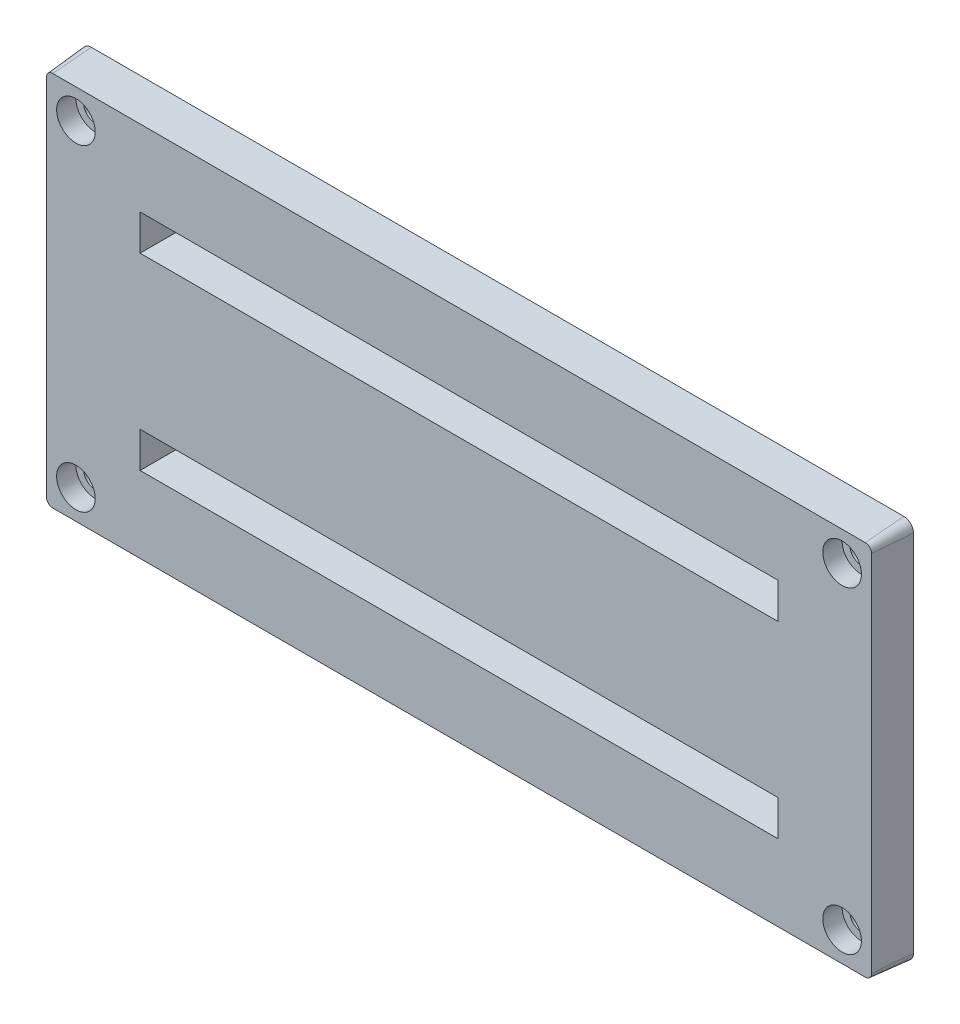
ISO-10303-21;
HEADER;
FILE_DESCRIPTION(('STEP AP214'),'2;1');
FILE_NAME('part.step','',(''),(''),'','','');
FILE_SCHEMA(('AUTOMOTIVE_DESIGN { 1 0 10303 214 1 1 1 1 }'));
ENDSEC;
DATA;
#1=APPLICATION_CONTEXT('core data for automotive mechanical design processes');
#2=APPLICATION_PROTOCOL_DEFINITION('international standard','automotive_design',2000,#1);
#3=PRODUCT_CONTEXT('',#1,'mechanical');
#4=PRODUCT('Part','Part','',(#3));
#5=PRODUCT_RELATED_PRODUCT_CATEGORY('part','',(#4));
#6=PRODUCT_DEFINITION_FORMATION('','',#4);
#7=PRODUCT_DEFINITION_CONTEXT('part definition',#1,'design');
#8=PRODUCT_DEFINITION('design','',#6,#7);
#9=PRODUCT_DEFINITION_SHAPE('','',#8);
#10=(LENGTH_UNIT() NAMED_UNIT(*) SI_UNIT(.MILLI.,.METRE.));
#11=(NAMED_UNIT(*) PLANE_ANGLE_UNIT() SI_UNIT($,.RADIAN.));
#12=(NAMED_UNIT(*) SI_UNIT($,.STERADIAN.) SOLID_ANGLE_UNIT());
#13=UNCERTAINTY_MEASURE_WITH_UNIT(LENGTH_MEASURE(1.E-05),#10,'distance_accuracy_value','');
#14=(GEOMETRIC_REPRESENTATION_CONTEXT(3) GLOBAL_UNCERTAINTY_ASSIGNED_CONTEXT((#13)) GLOBAL_UNIT_ASSIGNED_CONTEXT((#10,
#11,#12)) REPRESENTATION_CONTEXT('',''));
#15=CARTESIAN_POINT('',(0.,0.,0.));
#16=DIRECTION('',(0.,0.,1.));
#17=DIRECTION('',(1.,0.,0.));
#18=AXIS2_PLACEMENT_3D('',#15,#16,#17);
#19=CARTESIAN_POINT('',(39.7,26.2,11.6));
#20=DIRECTION('',(0.,0.,1.));
#21=DIRECTION('',(1.,0.,0.));
#22=AXIS2_PLACEMENT_3D('',#19,#20,#21);
#23=CYLINDRICAL_SURFACE('',#22,1.2);
#24=CARTESIAN_POINT('',(39.7,26.2,11.6));
#25=DIRECTION('',(0.,0.,1.));
#26=DIRECTION('',(1.,0.,0.));
#27=AXIS2_PLACEMENT_3D('',#24,#25,#26);
#28=CIRCLE('',#27,1.2);
#29=CARTESIAN_POINT('',(40.9,26.2,11.6));
#30=VERTEX_POINT('',#29);
#31=EDGE_CURVE('E285',#30,#30,#28,.T.);
#32=ORIENTED_EDGE('',*,*,#31,.F.);
#33=EDGE_LOOP('',(#32));
#34=FACE_BOUND('',#33,.T.);
#35=CARTESIAN_POINT('',(39.7,26.2,13.6));
#36=DIRECTION('',(0.,0.,1.));
#37=DIRECTION('',(1.,0.,0.));
#38=AXIS2_PLACEMENT_3D('',#35,#36,#37);
#39=CIRCLE('',#38,1.2);
#40=CARTESIAN_POINT('',(40.9,26.2,13.6));
#41=VERTEX_POINT('',#40);
#42=EDGE_CURVE('E46',#41,#41,#39,.F.);
#43=ORIENTED_EDGE('',*,*,#42,.F.);
#44=EDGE_LOOP('',(#43));
#45=FACE_BOUND('',#44,.T.);
#46=ADVANCED_FACE('F42',(#34,#45),#23,.F.);
#47=CARTESIAN_POINT('',(39.7,-6.7,11.6));
#48=DIRECTION('',(0.,0.,1.));
#49=DIRECTION('',(1.,0.,0.));
#50=AXIS2_PLACEMENT_3D('',#47,#48,#49);
#51=CYLINDRICAL_SURFACE('',#50,1.2);
#52=CARTESIAN_POINT('',(39.7,-6.7,11.6));
#53=DIRECTION('',(0.,0.,1.));
#54=DIRECTION('',(1.,0.,0.));
#55=AXIS2_PLACEMENT_3D('',#52,#53,#54);
#56=CIRCLE('',#55,1.2);
#57=CARTESIAN_POINT('',(40.9,-6.7,11.6));
#58=VERTEX_POINT('',#57);
#59=EDGE_CURVE('E312',#58,#58,#56,.T.);
#60=ORIENTED_EDGE('',*,*,#59,.F.);
#61=EDGE_LOOP('',(#60));
#62=FACE_BOUND('',#61,.T.);
#63=CARTESIAN_POINT('',(39.7,-6.7,13.6));
#64=DIRECTION('',(0.,0.,1.));
#65=DIRECTION('',(1.,0.,0.));
#66=AXIS2_PLACEMENT_3D('',#63,#64,#65);
#67=CIRCLE('',#66,1.2);
#68=CARTESIAN_POINT('',(40.9,-6.7,13.6));
#69=VERTEX_POINT('',#68);
#70=EDGE_CURVE('E290',#69,#69,#67,.F.);
#71=ORIENTED_EDGE('',*,*,#70,.F.);
#72=EDGE_LOOP('',(#71));
#73=FACE_BOUND('',#72,.T.);
#74=ADVANCED_FACE('F384',(#62,#73),#51,.F.);
#75=CARTESIAN_POINT('',(-39.7,-6.69999999999999,11.6));
#76=DIRECTION('',(0.,0.,1.));
#77=DIRECTION('',(1.,0.,0.));
#78=AXIS2_PLACEMENT_3D('',#75,#76,#77);
#79=CYLINDRICAL_SURFACE('',#78,1.2);
#80=CARTESIAN_POINT('',(-39.7,-6.69999999999999,11.6));
#81=DIRECTION('',(0.,0.,1.));
#82=DIRECTION('',(1.,0.,0.));
#83=AXIS2_PLACEMENT_3D('',#80,#81,#82);
#84=CIRCLE('',#83,1.2);
#85=CARTESIAN_POINT('',(-38.5,-6.69999999999999,11.6));
#86=VERTEX_POINT('',#85);
#87=EDGE_CURVE('E307',#86,#86,#84,.T.);
#88=ORIENTED_EDGE('',*,*,#87,.F.);
#89=EDGE_LOOP('',(#88));
#90=FACE_BOUND('',#89,.T.);
#91=CARTESIAN_POINT('',(-39.7,-6.69999999999999,13.6));
#92=DIRECTION('',(0.,0.,1.));
#93=DIRECTION('',(1.,0.,0.));
#94=AXIS2_PLACEMENT_3D('',#91,#92,#93);
#95=CIRCLE('',#94,1.2);
#96=CARTESIAN_POINT('',(-38.5,-6.69999999999999,13.6));
#97=VERTEX_POINT('',#96);
#98=EDGE_CURVE('E287',#97,#97,#95,.F.);
#99=ORIENTED_EDGE('',*,*,#98,.F.);
#100=EDGE_LOOP('',(#99));
#101=FACE_BOUND('',#100,.T.);
#102=ADVANCED_FACE('F390',(#90,#101),#79,.F.);
#103=CARTESIAN_POINT('',(-39.7,26.2,11.6));
#104=DIRECTION('',(0.,0.,1.));
#105=DIRECTION('',(1.,0.,0.));
#106=AXIS2_PLACEMENT_3D('',#103,#104,#105);
#107=CYLINDRICAL_SURFACE('',#106,1.2);
#108=CARTESIAN_POINT('',(-39.7,26.2,11.6));
#109=DIRECTION('',(0.,0.,1.));
#110=DIRECTION('',(1.,0.,0.));
#111=AXIS2_PLACEMENT_3D('',#108,#109,#110);
#112=CIRCLE('',#111,1.2);
#113=CARTESIAN_POINT('',(-38.5,26.2,11.6));
#114=VERTEX_POINT('',#113);
#115=EDGE_CURVE('E311',#114,#114,#112,.T.);
#116=ORIENTED_EDGE('',*,*,#115,.F.);
#117=EDGE_LOOP('',(#116));
#118=FACE_BOUND('',#117,.T.);
#119=CARTESIAN_POINT('',(-39.7,26.2,13.6));
#120=DIRECTION('',(0.,0.,1.));
#121=DIRECTION('',(1.,0.,0.));
#122=AXIS2_PLACEMENT_3D('',#119,#120,#121);
#123=CIRCLE('',#122,1.2);
#124=CARTESIAN_POINT('',(-38.5,26.2,13.6));
#125=VERTEX_POINT('',#124);
#126=EDGE_CURVE('E282',#125,#125,#123,.F.);
#127=ORIENTED_EDGE('',*,*,#126,.F.);
#128=EDGE_LOOP('',(#127));
#129=FACE_BOUND('',#128,.T.);
#130=ADVANCED_FACE('F397',(#118,#129),#107,.F.);
#131=CARTESIAN_POINT('',(-42.1,-9.10000000000001,15.6));
#132=DIRECTION('',(0.,0.,1.));
#133=DIRECTION('',(1.,0.,0.));
#134=AXIS2_PLACEMENT_3D('',#131,#132,#133);
#135=PLANE('',#134);
#136=CARTESIAN_POINT('',(-39.7,-6.69999999999999,15.6));
#137=DIRECTION('',(0.,0.,1.));
#138=DIRECTION('',(1.,0.,0.));
#139=AXIS2_PLACEMENT_3D('',#136,#137,#138);
#140=CIRCLE('',#139,2.);
#141=CARTESIAN_POINT('',(-37.7,-6.69999999999999,15.6));
#142=VERTEX_POINT('',#141);
#143=EDGE_CURVE('E597',#142,#142,#140,.T.);
#144=ORIENTED_EDGE('',*,*,#143,.F.);
#145=EDGE_LOOP('',(#144));
#146=FACE_BOUND('',#145,.T.);
#147=CARTESIAN_POINT('',(39.7,-6.7,15.6));
#148=DIRECTION('',(0.,0.,1.));
#149=DIRECTION('',(1.,0.,0.));
#150=AXIS2_PLACEMENT_3D('',#147,#148,#149);
#151=CIRCLE('',#150,2.);
#152=CARTESIAN_POINT('',(41.7,-6.7,15.6));
#153=VERTEX_POINT('',#152);
#154=EDGE_CURVE('E589',#153,#153,#151,.T.);
#155=ORIENTED_EDGE('',*,*,#154,.F.);
#156=EDGE_LOOP('',(#155));
#157=FACE_BOUND('',#156,.T.);
#158=CARTESIAN_POINT('',(39.7,26.2,15.6));
#159=DIRECTION('',(0.,0.,1.));
#160=DIRECTION('',(1.,0.,0.));
#161=AXIS2_PLACEMENT_3D('',#158,#159,#160);
#162=CIRCLE('',#161,2.);
#163=CARTESIAN_POINT('',(41.7,26.2,15.6));
#164=VERTEX_POINT('',#163);
#165=EDGE_CURVE('E587',#164,#164,#162,.T.);
#166=ORIENTED_EDGE('',*,*,#165,.F.);
#167=EDGE_LOOP('',(#166));
#168=FACE_BOUND('',#167,.T.);
#169=CARTESIAN_POINT('',(-39.7,26.2,15.6));
#170=DIRECTION('',(0.,0.,1.));
#171=DIRECTION('',(1.,0.,0.));
#172=AXIS2_PLACEMENT_3D('',#169,#170,#171);
#173=CIRCLE('',#172,2.);
#174=CARTESIAN_POINT('',(-37.7,26.2,15.6));
#175=VERTEX_POINT('',#174);
#176=EDGE_CURVE('E296',#175,#175,#173,.T.);
#177=ORIENTED_EDGE('',*,*,#176,.F.);
#178=EDGE_LOOP('',(#177));
#179=FACE_BOUND('',#178,.T.);
#180=CARTESIAN_POINT('',(-42.1,-9.10000000000001,15.6));
#181=DIRECTION('',(0.,0.,1.));
#182=DIRECTION('',(1.,0.,0.));
#183=AXIS2_PLACEMENT_3D('',#180,#181,#182);
#184=CIRCLE('',#183,0.650045345896302);
#185=CARTESIAN_POINT('',(-42.7500453458963,-9.10000000000001,15.6));
#186=VERTEX_POINT('',#185);
#187=CARTESIAN_POINT('',(-42.1,-9.75004534589631,15.6));
#188=VERTEX_POINT('',#187);
#189=EDGE_CURVE('E182',#186,#188,#184,.T.);
#190=ORIENTED_EDGE('',*,*,#189,.T.);
#191=DIRECTION('',(-1.,0.,0.));
#192=VECTOR('',#191,1.);
#193=CARTESIAN_POINT('',(-42.1,-9.75004534589631,15.6));
#194=LINE('',#193,#192);
#195=CARTESIAN_POINT('',(42.1,-9.75004534589631,15.6));
#196=VERTEX_POINT('',#195);
#197=EDGE_CURVE('E267',#188,#196,#194,.F.);
#198=ORIENTED_EDGE('',*,*,#197,.T.);
#199=CARTESIAN_POINT('',(42.1,-9.1,15.6));
#200=DIRECTION('',(0.,0.,1.));
#201=DIRECTION('',(1.,0.,0.));
#202=AXIS2_PLACEMENT_3D('',#199,#200,#201);
#203=CIRCLE('',#202,0.650045345896304);
#204=CARTESIAN_POINT('',(42.7500453458963,-9.1,15.6));
#205=VERTEX_POINT('',#204);
#206=EDGE_CURVE('E270',#196,#205,#203,.T.);
#207=ORIENTED_EDGE('',*,*,#206,.T.);
#208=DIRECTION('',(0.,-1.,0.));
#209=VECTOR('',#208,1.);
#210=CARTESIAN_POINT('',(42.7500453458963,-9.1,15.6));
#211=LINE('',#210,#209);
#212=CARTESIAN_POINT('',(42.7500453458963,28.6,15.6));
#213=VERTEX_POINT('',#212);
#214=EDGE_CURVE('E272',#205,#213,#211,.F.);
#215=ORIENTED_EDGE('',*,*,#214,.T.);
#216=CARTESIAN_POINT('',(42.1,28.6,15.6));
#217=DIRECTION('',(0.,0.,1.));
#218=DIRECTION('',(1.,0.,0.));
#219=AXIS2_PLACEMENT_3D('',#216,#217,#218);
#220=CIRCLE('',#219,0.650045345896302);
#221=CARTESIAN_POINT('',(42.1,29.2500453458963,15.6));
#222=VERTEX_POINT('',#221);
#223=EDGE_CURVE('E275',#213,#222,#220,.T.);
#224=ORIENTED_EDGE('',*,*,#223,.T.);
#225=DIRECTION('',(1.,0.,0.));
#226=VECTOR('',#225,1.);
#227=CARTESIAN_POINT('',(42.1,29.2500453458963,15.6));
#228=LINE('',#227,#226);
#229=CARTESIAN_POINT('',(-42.1,29.2500453458963,15.6));
#230=VERTEX_POINT('',#229);
#231=EDGE_CURVE('E277',#222,#230,#228,.F.);
#232=ORIENTED_EDGE('',*,*,#231,.T.);
#233=CARTESIAN_POINT('',(-42.1,28.6,15.6));
#234=DIRECTION('',(0.,0.,1.));
#235=DIRECTION('',(1.,0.,0.));
#236=AXIS2_PLACEMENT_3D('',#233,#234,#235);
#237=CIRCLE('',#236,0.650045345896304);
#238=CARTESIAN_POINT('',(-42.7500453458963,28.6,15.6));
#239=VERTEX_POINT('',#238);
#240=EDGE_CURVE('E102',#230,#239,#237,.T.);
#241=ORIENTED_EDGE('',*,*,#240,.T.);
#242=DIRECTION('',(0.,1.,0.));
#243=VECTOR('',#242,1.);
#244=CARTESIAN_POINT('',(-42.7500453458963,28.6,15.6));
#245=LINE('',#244,#243);
#246=EDGE_CURVE('E107',#239,#186,#245,.F.);
#247=ORIENTED_EDGE('',*,*,#246,.T.);
#248=EDGE_LOOP('',(#190,#198,#207,#215,#224,#232,#241,#247));
#249=FACE_BOUND('',#248,.T.);
#250=DIRECTION('',(0.,-1.,0.));
#251=VECTOR('',#250,1.);
#252=CARTESIAN_POINT('',(-33.0499546541037,1.5,15.6));
#253=LINE('',#252,#251);
#254=CARTESIAN_POINT('',(-33.0499546541037,1.8499546541037,15.6));
#255=VERTEX_POINT('',#254);
#256=CARTESIAN_POINT('',(-33.0499546541037,-1.8499546541037,15.6));
#257=VERTEX_POINT('',#256);
#258=EDGE_CURVE('E222',#255,#257,#253,.T.);
#259=ORIENTED_EDGE('',*,*,#258,.F.);
#260=DIRECTION('',(-1.,0.,0.));
#261=VECTOR('',#260,1.);
#262=CARTESIAN_POINT('',(32.7,1.84995465410369,15.6));
#263=LINE('',#262,#261);
#264=CARTESIAN_POINT('',(33.0499546541037,1.84995465410369,15.6));
#265=VERTEX_POINT('',#264);
#266=EDGE_CURVE('E132',#265,#255,#263,.T.);
#267=ORIENTED_EDGE('',*,*,#266,.F.);
#268=DIRECTION('',(0.,1.,0.));
#269=VECTOR('',#268,1.);
#270=CARTESIAN_POINT('',(33.0499546541037,-1.49999999999999,15.6));
#271=LINE('',#270,#269);
#272=CARTESIAN_POINT('',(33.0499546541037,-1.84995465410369,15.6));
#273=VERTEX_POINT('',#272);
#274=EDGE_CURVE('E217',#273,#265,#271,.T.);
#275=ORIENTED_EDGE('',*,*,#274,.F.);
#276=DIRECTION('',(1.,0.,0.));
#277=VECTOR('',#276,1.);
#278=CARTESIAN_POINT('',(-32.7,-1.8499546541037,15.6));
#279=LINE('',#278,#277);
#280=EDGE_CURVE('E224',#257,#273,#279,.T.);
#281=ORIENTED_EDGE('',*,*,#280,.F.);
#282=EDGE_LOOP('',(#259,#267,#275,#281));
#283=FACE_BOUND('',#282,.T.);
#284=DIRECTION('',(0.,1.,0.));
#285=VECTOR('',#284,1.);
#286=CARTESIAN_POINT('',(33.0499546541037,18.,15.6));
#287=LINE('',#286,#285);
#288=CARTESIAN_POINT('',(33.0499546541037,17.6500453458963,15.6));
#289=VERTEX_POINT('',#288);
#290=CARTESIAN_POINT('',(33.0499546541037,21.3499546541037,15.6));
#291=VERTEX_POINT('',#290);
#292=EDGE_CURVE('E244',#289,#291,#287,.T.);
#293=ORIENTED_EDGE('',*,*,#292,.F.);
#294=DIRECTION('',(1.,0.,0.));
#295=VECTOR('',#294,1.);
#296=CARTESIAN_POINT('',(-32.7,17.6500453458963,15.6));
#297=LINE('',#296,#295);
#298=CARTESIAN_POINT('',(-33.0499546541037,17.6500453458963,15.6));
#299=VERTEX_POINT('',#298);
#300=EDGE_CURVE('E241',#299,#289,#297,.T.);
#301=ORIENTED_EDGE('',*,*,#300,.F.);
#302=DIRECTION('',(0.,-1.,0.));
#303=VECTOR('',#302,1.);
#304=CARTESIAN_POINT('',(-33.0499546541037,21.,15.6));
#305=LINE('',#304,#303);
#306=CARTESIAN_POINT('',(-33.0499546541037,21.3499546541037,15.6));
#307=VERTEX_POINT('',#306);
#308=EDGE_CURVE('E231',#307,#299,#305,.T.);
#309=ORIENTED_EDGE('',*,*,#308,.F.);
#310=DIRECTION('',(-1.,0.,0.));
#311=VECTOR('',#310,1.);
#312=CARTESIAN_POINT('',(32.7,21.3499546541037,15.6));
#313=LINE('',#312,#311);
#314=EDGE_CURVE('E247',#291,#307,#313,.T.);
#315=ORIENTED_EDGE('',*,*,#314,.F.);
#316=EDGE_LOOP('',(#293,#301,#309,#315));
#317=FACE_BOUND('',#316,.T.);
#318=ADVANCED_FACE('F346',(#146,#157,#168,#179,#249,#283,#317),#135,.T.);
#319=CARTESIAN_POINT('',(-42.1,-9.10000000000001,11.6));
#320=DIRECTION('',(0.,0.,1.));
#321=DIRECTION('',(1.,0.,0.));
#322=AXIS2_PLACEMENT_3D('',#319,#320,#321);
#323=PLANE('',#322);
#324=ORIENTED_EDGE('',*,*,#87,.T.);
#325=EDGE_LOOP('',(#324));
#326=FACE_BOUND('',#325,.T.);
#327=ORIENTED_EDGE('',*,*,#59,.T.);
#328=EDGE_LOOP('',(#327));
#329=FACE_BOUND('',#328,.T.);
#330=ORIENTED_EDGE('',*,*,#31,.T.);
#331=EDGE_LOOP('',(#330));
#332=FACE_BOUND('',#331,.T.);
#333=ORIENTED_EDGE('',*,*,#115,.T.);
#334=EDGE_LOOP('',(#333));
#335=FACE_BOUND('',#334,.T.);
#336=DIRECTION('',(-1.,0.,0.));
#337=VECTOR('',#336,1.);
#338=CARTESIAN_POINT('',(32.7,1.49999999999999,11.6));
#339=LINE('',#338,#337);
#340=CARTESIAN_POINT('',(32.7,1.49999999999999,11.6));
#341=VERTEX_POINT('',#340);
#342=CARTESIAN_POINT('',(-32.7,1.5,11.6));
#343=VERTEX_POINT('',#342);
#344=EDGE_CURVE('E115',#341,#343,#339,.T.);
#345=ORIENTED_EDGE('',*,*,#344,.T.);
#346=DIRECTION('',(0.,-1.,0.));
#347=VECTOR('',#346,1.);
#348=CARTESIAN_POINT('',(-32.7,1.5,11.6));
#349=LINE('',#348,#347);
#350=CARTESIAN_POINT('',(-32.7,-1.5,11.6));
#351=VERTEX_POINT('',#350);
#352=EDGE_CURVE('E334',#343,#351,#349,.T.);
#353=ORIENTED_EDGE('',*,*,#352,.T.);
#354=DIRECTION('',(1.,0.,0.));
#355=VECTOR('',#354,1.);
#356=CARTESIAN_POINT('',(-32.7,-1.5,11.6));
#357=LINE('',#356,#355);
#358=CARTESIAN_POINT('',(32.7,-1.49999999999999,11.6));
#359=VERTEX_POINT('',#358);
#360=EDGE_CURVE('E336',#351,#359,#357,.T.);
#361=ORIENTED_EDGE('',*,*,#360,.T.);
#362=DIRECTION('',(0.,1.,0.));
#363=VECTOR('',#362,1.);
#364=CARTESIAN_POINT('',(32.7,-1.49999999999999,11.6));
#365=LINE('',#364,#363);
#366=EDGE_CURVE('E204',#359,#341,#365,.T.);
#367=ORIENTED_EDGE('',*,*,#366,.T.);
#368=EDGE_LOOP('',(#345,#353,#361,#367));
#369=FACE_BOUND('',#368,.T.);
#370=CARTESIAN_POINT('',(-42.1,-9.10000000000001,11.6));
#371=DIRECTION('',(0.,0.,1.));
#372=DIRECTION('',(1.,0.,0.));
#373=AXIS2_PLACEMENT_3D('',#370,#371,#372);
#374=CIRCLE('',#373,0.999999999999999);
#375=CARTESIAN_POINT('',(-43.1,-9.10000000000001,11.6));
#376=VERTEX_POINT('',#375);
#377=CARTESIAN_POINT('',(-42.1,-10.1,11.6));
#378=VERTEX_POINT('',#377);
#379=EDGE_CURVE('E188',#376,#378,#374,.T.);
#380=ORIENTED_EDGE('',*,*,#379,.F.);
#381=DIRECTION('',(0.,-1.,0.));
#382=VECTOR('',#381,1.);
#383=CARTESIAN_POINT('',(-43.1,28.6,11.6));
#384=LINE('',#383,#382);
#385=CARTESIAN_POINT('',(-43.1,28.6,11.6));
#386=VERTEX_POINT('',#385);
#387=EDGE_CURVE('E174',#386,#376,#384,.T.);
#388=ORIENTED_EDGE('',*,*,#387,.F.);
#389=CARTESIAN_POINT('',(-42.1,28.6,11.6));
#390=DIRECTION('',(0.,0.,1.));
#391=DIRECTION('',(1.,0.,0.));
#392=AXIS2_PLACEMENT_3D('',#389,#390,#391);
#393=CIRCLE('',#392,1.);
#394=CARTESIAN_POINT('',(-42.1,29.6,11.6));
#395=VERTEX_POINT('',#394);
#396=EDGE_CURVE('E169',#395,#386,#393,.T.);
#397=ORIENTED_EDGE('',*,*,#396,.F.);
#398=DIRECTION('',(-1.,0.,0.));
#399=VECTOR('',#398,1.);
#400=CARTESIAN_POINT('',(42.1,29.6,11.6));
#401=LINE('',#400,#399);
#402=CARTESIAN_POINT('',(42.1,29.6,11.6));
#403=VERTEX_POINT('',#402);
#404=EDGE_CURVE('E213',#403,#395,#401,.T.);
#405=ORIENTED_EDGE('',*,*,#404,.F.);
#406=CARTESIAN_POINT('',(42.1,28.6,11.6));
#407=DIRECTION('',(0.,0.,1.));
#408=DIRECTION('',(1.,0.,0.));
#409=AXIS2_PLACEMENT_3D('',#406,#407,#408);
#410=CIRCLE('',#409,0.999999999999999);
#411=CARTESIAN_POINT('',(43.1,28.6,11.6));
#412=VERTEX_POINT('',#411);
#413=EDGE_CURVE('E211',#412,#403,#410,.T.);
#414=ORIENTED_EDGE('',*,*,#413,.F.);
#415=DIRECTION('',(0.,1.,0.));
#416=VECTOR('',#415,1.);
#417=CARTESIAN_POINT('',(43.1,-9.1,11.6));
#418=LINE('',#417,#416);
#419=CARTESIAN_POINT('',(43.1,-9.1,11.6));
#420=VERTEX_POINT('',#419);
#421=EDGE_CURVE('E208',#420,#412,#418,.T.);
#422=ORIENTED_EDGE('',*,*,#421,.F.);
#423=CARTESIAN_POINT('',(42.1,-9.1,11.6));
#424=DIRECTION('',(0.,0.,1.));
#425=DIRECTION('',(1.,0.,0.));
#426=AXIS2_PLACEMENT_3D('',#423,#424,#425);
#427=CIRCLE('',#426,1.);
#428=CARTESIAN_POINT('',(42.1,-10.1,11.6));
#429=VERTEX_POINT('',#428);
#430=EDGE_CURVE('E199',#429,#420,#427,.T.);
#431=ORIENTED_EDGE('',*,*,#430,.F.);
#432=DIRECTION('',(1.,0.,0.));
#433=VECTOR('',#432,1.);
#434=CARTESIAN_POINT('',(-42.1,-10.1,11.6));
#435=LINE('',#434,#433);
#436=EDGE_CURVE('E193',#378,#429,#435,.T.);
#437=ORIENTED_EDGE('',*,*,#436,.F.);
#438=EDGE_LOOP('',(#380,#388,#397,#405,#414,#422,#431,#437));
#439=FACE_BOUND('',#438,.T.);
#440=DIRECTION('',(1.,0.,0.));
#441=VECTOR('',#440,1.);
#442=CARTESIAN_POINT('',(-32.7,18.,11.6));
#443=LINE('',#442,#441);
#444=CARTESIAN_POINT('',(-32.7,18.,11.6));
#445=VERTEX_POINT('',#444);
#446=CARTESIAN_POINT('',(32.7,18.,11.6));
#447=VERTEX_POINT('',#446);
#448=EDGE_CURVE('E319',#445,#447,#443,.T.);
#449=ORIENTED_EDGE('',*,*,#448,.T.);
#450=DIRECTION('',(0.,1.,0.));
#451=VECTOR('',#450,1.);
#452=CARTESIAN_POINT('',(32.7,18.,11.6));
#453=LINE('',#452,#451);
#454=CARTESIAN_POINT('',(32.7,21.,11.6));
#455=VERTEX_POINT('',#454);
#456=EDGE_CURVE('E323',#447,#455,#453,.T.);
#457=ORIENTED_EDGE('',*,*,#456,.T.);
#458=DIRECTION('',(-1.,0.,0.));
#459=VECTOR('',#458,1.);
#460=CARTESIAN_POINT('',(32.7,21.,11.6));
#461=LINE('',#460,#459);
#462=CARTESIAN_POINT('',(-32.7,21.,11.6));
#463=VERTEX_POINT('',#462);
#464=EDGE_CURVE('E327',#455,#463,#461,.T.);
#465=ORIENTED_EDGE('',*,*,#464,.T.);
#466=DIRECTION('',(0.,-1.,0.));
#467=VECTOR('',#466,1.);
#468=CARTESIAN_POINT('',(-32.7,21.,11.6));
#469=LINE('',#468,#467);
#470=EDGE_CURVE('E245',#463,#445,#469,.T.);
#471=ORIENTED_EDGE('',*,*,#470,.T.);
#472=EDGE_LOOP('',(#449,#457,#465,#471));
#473=FACE_BOUND('',#472,.T.);
#474=ADVANCED_FACE('F190',(#326,#329,#332,#335,#369,#439,#473),#323,.F.);
#475=CARTESIAN_POINT('',(-42.1,-9.10000000000001,11.6));
#476=DIRECTION('',(0.,0.,-1.));
#477=DIRECTION('',(1.,0.,0.));
#478=AXIS2_PLACEMENT_3D('',#475,#476,#477);
#479=CONICAL_SURFACE('',#478,0.999999999999999,0.0872664625997167);
#480=ORIENTED_EDGE('',*,*,#379,.T.);
#481=DIRECTION('',(0.,-0.0871557427476584,-0.996194698091745));
#482=VECTOR('',#481,1.);
#483=CARTESIAN_POINT('',(-42.1,-10.1,11.6));
#484=LINE('',#483,#482);
#485=EDGE_CURVE('E11',#188,#378,#484,.T.);
#486=ORIENTED_EDGE('',*,*,#485,.F.);
#487=ORIENTED_EDGE('',*,*,#189,.F.);
#488=DIRECTION('',(-0.0871557427476584,0.,-0.996194698091745));
#489=VECTOR('',#488,1.);
#490=CARTESIAN_POINT('',(-43.1,-9.10000000000001,11.6));
#491=LINE('',#490,#489);
#492=EDGE_CURVE('E177',#186,#376,#491,.T.);
#493=ORIENTED_EDGE('',*,*,#492,.T.);
#494=EDGE_LOOP('',(#480,#486,#487,#493));
#495=FACE_BOUND('',#494,.T.);
#496=ADVANCED_FACE('F186',(#495),#479,.T.);
#497=CARTESIAN_POINT('',(-42.1,-10.1,11.6));
#498=DIRECTION('',(0.,-0.996194698091746,0.0871557427476584));
#499=DIRECTION('',(0.,-0.0871557427476584,-0.996194698091746));
#500=AXIS2_PLACEMENT_3D('',#497,#498,#499);
#501=PLANE('',#500);
#502=ORIENTED_EDGE('',*,*,#436,.T.);
#503=DIRECTION('',(0.,-0.0871557427476584,-0.996194698091745));
#504=VECTOR('',#503,1.);
#505=CARTESIAN_POINT('',(42.1,-10.1,11.6));
#506=LINE('',#505,#504);
#507=EDGE_CURVE('E53',#196,#429,#506,.T.);
#508=ORIENTED_EDGE('',*,*,#507,.F.);
#509=ORIENTED_EDGE('',*,*,#197,.F.);
#510=ORIENTED_EDGE('',*,*,#485,.T.);
#511=EDGE_LOOP('',(#502,#508,#509,#510));
#512=FACE_BOUND('',#511,.T.);
#513=ADVANCED_FACE('F417',(#512),#501,.T.);
#514=CARTESIAN_POINT('',(42.1,-9.1,11.6));
#515=DIRECTION('',(0.,0.,-1.));
#516=DIRECTION('',(1.,0.,0.));
#517=AXIS2_PLACEMENT_3D('',#514,#515,#516);
#518=CONICAL_SURFACE('',#517,1.,0.0872664625997167);
#519=ORIENTED_EDGE('',*,*,#430,.T.);
#520=DIRECTION('',(0.0871557427476584,0.,-0.996194698091745));
#521=VECTOR('',#520,1.);
#522=CARTESIAN_POINT('',(43.1,-9.1,11.6));
#523=LINE('',#522,#521);
#524=EDGE_CURVE('E261',#205,#420,#523,.T.);
#525=ORIENTED_EDGE('',*,*,#524,.F.);
#526=ORIENTED_EDGE('',*,*,#206,.F.);
#527=ORIENTED_EDGE('',*,*,#507,.T.);
#528=EDGE_LOOP('',(#519,#525,#526,#527));
#529=FACE_BOUND('',#528,.T.);
#530=ADVANCED_FACE('F434',(#529),#518,.T.);
#531=CARTESIAN_POINT('',(43.1,-9.1,11.6));
#532=DIRECTION('',(0.996194698091746,0.,0.0871557427476584));
#533=DIRECTION('',(0.0871557427476584,0.,-0.996194698091746));
#534=AXIS2_PLACEMENT_3D('',#531,#532,#533);
#535=PLANE('',#534);
#536=ORIENTED_EDGE('',*,*,#421,.T.);
#537=DIRECTION('',(0.0871557427476584,0.,-0.996194698091745));
#538=VECTOR('',#537,1.);
#539=CARTESIAN_POINT('',(43.1,28.6,11.6));
#540=LINE('',#539,#538);
#541=EDGE_CURVE('E258',#213,#412,#540,.T.);
#542=ORIENTED_EDGE('',*,*,#541,.F.);
#543=ORIENTED_EDGE('',*,*,#214,.F.);
#544=ORIENTED_EDGE('',*,*,#524,.T.);
#545=EDGE_LOOP('',(#536,#542,#543,#544));
#546=FACE_BOUND('',#545,.T.);
#547=ADVANCED_FACE('F430',(#546),#535,.T.);
#548=CARTESIAN_POINT('',(42.1,28.6,11.6));
#549=DIRECTION('',(0.,0.,-1.));
#550=DIRECTION('',(1.,0.,0.));
#551=AXIS2_PLACEMENT_3D('',#548,#549,#550);
#552=CONICAL_SURFACE('',#551,0.999999999999999,0.0872664625997167);
#553=ORIENTED_EDGE('',*,*,#413,.T.);
#554=DIRECTION('',(0.,0.0871557427476584,-0.996194698091745));
#555=VECTOR('',#554,1.);
#556=CARTESIAN_POINT('',(42.1,29.6,11.6));
#557=LINE('',#556,#555);
#558=EDGE_CURVE('E255',#222,#403,#557,.T.);
#559=ORIENTED_EDGE('',*,*,#558,.F.);
#560=ORIENTED_EDGE('',*,*,#223,.F.);
#561=ORIENTED_EDGE('',*,*,#541,.T.);
#562=EDGE_LOOP('',(#553,#559,#560,#561));
#563=FACE_BOUND('',#562,.T.);
#564=ADVANCED_FACE('F426',(#563),#552,.T.);
#565=CARTESIAN_POINT('',(42.1,29.6,11.6));
#566=DIRECTION('',(0.,0.996194698091746,0.0871557427476584));
#567=DIRECTION('',(0.,-0.0871557427476584,0.996194698091746));
#568=AXIS2_PLACEMENT_3D('',#565,#566,#567);
#569=PLANE('',#568);
#570=ORIENTED_EDGE('',*,*,#404,.T.);
#571=DIRECTION('',(0.,0.0871557427476584,-0.996194698091745));
#572=VECTOR('',#571,1.);
#573=CARTESIAN_POINT('',(-42.1,29.6,11.6));
#574=LINE('',#573,#572);
#575=EDGE_CURVE('E253',#230,#395,#574,.T.);
#576=ORIENTED_EDGE('',*,*,#575,.F.);
#577=ORIENTED_EDGE('',*,*,#231,.F.);
#578=ORIENTED_EDGE('',*,*,#558,.T.);
#579=EDGE_LOOP('',(#570,#576,#577,#578));
#580=FACE_BOUND('',#579,.T.);
#581=ADVANCED_FACE('F423',(#580),#569,.T.);
#582=CARTESIAN_POINT('',(-42.1,28.6,11.6));
#583=DIRECTION('',(0.,0.,-1.));
#584=DIRECTION('',(1.,0.,0.));
#585=AXIS2_PLACEMENT_3D('',#582,#583,#584);
#586=CONICAL_SURFACE('',#585,1.,0.0872664625997167);
#587=ORIENTED_EDGE('',*,*,#396,.T.);
#588=DIRECTION('',(-0.0871557427476584,0.,-0.996194698091745));
#589=VECTOR('',#588,1.);
#590=CARTESIAN_POINT('',(-43.1,28.6,11.6));
#591=LINE('',#590,#589);
#592=EDGE_CURVE('E179',#239,#386,#591,.T.);
#593=ORIENTED_EDGE('',*,*,#592,.F.);
#594=ORIENTED_EDGE('',*,*,#240,.F.);
#595=ORIENTED_EDGE('',*,*,#575,.T.);
#596=EDGE_LOOP('',(#587,#593,#594,#595));
#597=FACE_BOUND('',#596,.T.);
#598=ADVANCED_FACE('F420',(#597),#586,.T.);
#599=CARTESIAN_POINT('',(-43.1,28.6,11.6));
#600=DIRECTION('',(-0.996194698091746,0.,0.0871557427476584));
#601=DIRECTION('',(0.0871557427476584,0.,0.996194698091746));
#602=AXIS2_PLACEMENT_3D('',#599,#600,#601);
#603=PLANE('',#602);
#604=ORIENTED_EDGE('',*,*,#387,.T.);
#605=ORIENTED_EDGE('',*,*,#492,.F.);
#606=ORIENTED_EDGE('',*,*,#246,.F.);
#607=ORIENTED_EDGE('',*,*,#592,.T.);
#608=EDGE_LOOP('',(#604,#605,#606,#607));
#609=FACE_BOUND('',#608,.T.);
#610=ADVANCED_FACE('F176',(#609),#603,.T.);
#611=CARTESIAN_POINT('',(32.7,1.49999999999999,11.6));
#612=DIRECTION('',(0.,-0.996194698091746,0.0871557427476584));
#613=DIRECTION('',(0.,-0.0871557427476584,-0.996194698091746));
#614=AXIS2_PLACEMENT_3D('',#611,#612,#613);
#615=PLANE('',#614);
#616=ORIENTED_EDGE('',*,*,#344,.F.);
#617=DIRECTION('',(-0.0868265938642478,-0.0868265938642478,-0.992432509138967));
#618=VECTOR('',#617,1.);
#619=CARTESIAN_POINT('',(32.7,1.49999999999999,11.6));
#620=LINE('',#619,#618);
#621=EDGE_CURVE('E216',#265,#341,#620,.T.);
#622=ORIENTED_EDGE('',*,*,#621,.F.);
#623=ORIENTED_EDGE('',*,*,#266,.T.);
#624=DIRECTION('',(0.0868265938642478,-0.0868265938642478,-0.992432509138967));
#625=VECTOR('',#624,1.);
#626=CARTESIAN_POINT('',(-32.7,1.5,11.6));
#627=LINE('',#626,#625);
#628=EDGE_CURVE('E195',#255,#343,#627,.T.);
#629=ORIENTED_EDGE('',*,*,#628,.T.);
#630=EDGE_LOOP('',(#616,#622,#623,#629));
#631=FACE_BOUND('',#630,.T.);
#632=ADVANCED_FACE('F343',(#631),#615,.T.);
#633=CARTESIAN_POINT('',(-32.7,1.5,11.6));
#634=DIRECTION('',(0.996194698091746,0.,0.0871557427476584));
#635=DIRECTION('',(0.0871557427476584,0.,-0.996194698091746));
#636=AXIS2_PLACEMENT_3D('',#633,#634,#635);
#637=PLANE('',#636);
#638=ORIENTED_EDGE('',*,*,#352,.F.);
#639=ORIENTED_EDGE('',*,*,#628,.F.);
#640=ORIENTED_EDGE('',*,*,#258,.T.);
#641=DIRECTION('',(0.0868265938642478,0.0868265938642478,-0.992432509138967));
#642=VECTOR('',#641,1.);
#643=CARTESIAN_POINT('',(-32.7,-1.5,11.6));
#644=LINE('',#643,#642);
#645=EDGE_CURVE('E201',#257,#351,#644,.T.);
#646=ORIENTED_EDGE('',*,*,#645,.T.);
#647=EDGE_LOOP('',(#638,#639,#640,#646));
#648=FACE_BOUND('',#647,.T.);
#649=ADVANCED_FACE('F352',(#648),#637,.T.);
#650=CARTESIAN_POINT('',(-32.7,-1.5,11.6));
#651=DIRECTION('',(0.,0.996194698091746,0.0871557427476584));
#652=DIRECTION('',(0.,-0.0871557427476584,0.996194698091746));
#653=AXIS2_PLACEMENT_3D('',#650,#651,#652);
#654=PLANE('',#653);
#655=ORIENTED_EDGE('',*,*,#360,.F.);
#656=ORIENTED_EDGE('',*,*,#645,.F.);
#657=ORIENTED_EDGE('',*,*,#280,.T.);
#658=DIRECTION('',(-0.0868265938642478,0.0868265938642478,-0.992432509138967));
#659=VECTOR('',#658,1.);
#660=CARTESIAN_POINT('',(32.7,-1.49999999999999,11.6));
#661=LINE('',#660,#659);
#662=EDGE_CURVE('E140',#273,#359,#661,.T.);
#663=ORIENTED_EDGE('',*,*,#662,.T.);
#664=EDGE_LOOP('',(#655,#656,#657,#663));
#665=FACE_BOUND('',#664,.T.);
#666=ADVANCED_FACE('F353',(#665),#654,.T.);
#667=CARTESIAN_POINT('',(32.7,-1.49999999999999,11.6));
#668=DIRECTION('',(-0.996194698091746,0.,0.0871557427476584));
#669=DIRECTION('',(0.0871557427476584,0.,0.996194698091746));
#670=AXIS2_PLACEMENT_3D('',#667,#668,#669);
#671=PLANE('',#670);
#672=ORIENTED_EDGE('',*,*,#366,.F.);
#673=ORIENTED_EDGE('',*,*,#662,.F.);
#674=ORIENTED_EDGE('',*,*,#274,.T.);
#675=ORIENTED_EDGE('',*,*,#621,.T.);
#676=EDGE_LOOP('',(#672,#673,#674,#675));
#677=FACE_BOUND('',#676,.T.);
#678=ADVANCED_FACE('F341',(#677),#671,.T.);
#679=CARTESIAN_POINT('',(-32.7,18.,11.6));
#680=DIRECTION('',(0.,0.996194698091746,0.0871557427476584));
#681=DIRECTION('',(0.,-0.0871557427476584,0.996194698091746));
#682=AXIS2_PLACEMENT_3D('',#679,#680,#681);
#683=PLANE('',#682);
#684=ORIENTED_EDGE('',*,*,#448,.F.);
#685=DIRECTION('',(0.0868265938642478,0.0868265938642478,-0.992432509138967));
#686=VECTOR('',#685,1.);
#687=CARTESIAN_POINT('',(-32.7,18.,11.6));
#688=LINE('',#687,#686);
#689=EDGE_CURVE('E228',#299,#445,#688,.T.);
#690=ORIENTED_EDGE('',*,*,#689,.F.);
#691=ORIENTED_EDGE('',*,*,#300,.T.);
#692=DIRECTION('',(-0.0868265938642478,0.0868265938642478,-0.992432509138967));
#693=VECTOR('',#692,1.);
#694=CARTESIAN_POINT('',(32.7,18.,11.6));
#695=LINE('',#694,#693);
#696=EDGE_CURVE('E232',#289,#447,#695,.T.);
#697=ORIENTED_EDGE('',*,*,#696,.T.);
#698=EDGE_LOOP('',(#684,#690,#691,#697));
#699=FACE_BOUND('',#698,.T.);
#700=ADVANCED_FACE('F369',(#699),#683,.T.);
#701=CARTESIAN_POINT('',(32.7,18.,11.6));
#702=DIRECTION('',(-0.996194698091746,0.,0.0871557427476584));
#703=DIRECTION('',(0.0871557427476584,0.,0.996194698091746));
#704=AXIS2_PLACEMENT_3D('',#701,#702,#703);
#705=PLANE('',#704);
#706=ORIENTED_EDGE('',*,*,#456,.F.);
#707=ORIENTED_EDGE('',*,*,#696,.F.);
#708=ORIENTED_EDGE('',*,*,#292,.T.);
#709=DIRECTION('',(-0.0868265938642478,-0.0868265938642478,-0.992432509138967));
#710=VECTOR('',#709,1.);
#711=CARTESIAN_POINT('',(32.7,21.,11.6));
#712=LINE('',#711,#710);
#713=EDGE_CURVE('E236',#291,#455,#712,.T.);
#714=ORIENTED_EDGE('',*,*,#713,.T.);
#715=EDGE_LOOP('',(#706,#707,#708,#714));
#716=FACE_BOUND('',#715,.T.);
#717=ADVANCED_FACE('F364',(#716),#705,.T.);
#718=CARTESIAN_POINT('',(32.7,21.,11.6));
#719=DIRECTION('',(0.,-0.996194698091746,0.0871557427476584));
#720=DIRECTION('',(0.,-0.0871557427476584,-0.996194698091746));
#721=AXIS2_PLACEMENT_3D('',#718,#719,#720);
#722=PLANE('',#721);
#723=ORIENTED_EDGE('',*,*,#464,.F.);
#724=ORIENTED_EDGE('',*,*,#713,.F.);
#725=ORIENTED_EDGE('',*,*,#314,.T.);
#726=DIRECTION('',(0.0868265938642478,-0.0868265938642478,-0.992432509138967));
#727=VECTOR('',#726,1.);
#728=CARTESIAN_POINT('',(-32.7,21.,11.6));
#729=LINE('',#728,#727);
#730=EDGE_CURVE('E62',#307,#463,#729,.T.);
#731=ORIENTED_EDGE('',*,*,#730,.T.);
#732=EDGE_LOOP('',(#723,#724,#725,#731));
#733=FACE_BOUND('',#732,.T.);
#734=ADVANCED_FACE('F375',(#733),#722,.T.);
#735=CARTESIAN_POINT('',(-32.7,21.,11.6));
#736=DIRECTION('',(0.996194698091745,0.,0.0871557427476584));
#737=DIRECTION('',(0.0871557427476584,0.,-0.996194698091746));
#738=AXIS2_PLACEMENT_3D('',#735,#736,#737);
#739=PLANE('',#738);
#740=ORIENTED_EDGE('',*,*,#470,.F.);
#741=ORIENTED_EDGE('',*,*,#730,.F.);
#742=ORIENTED_EDGE('',*,*,#308,.T.);
#743=ORIENTED_EDGE('',*,*,#689,.T.);
#744=EDGE_LOOP('',(#740,#741,#742,#743));
#745=FACE_BOUND('',#744,.T.);
#746=ADVANCED_FACE('F44',(#745),#739,.T.);
#747=CARTESIAN_POINT('',(-39.7,26.2,13.6));
#748=DIRECTION('',(0.,0.,1.));
#749=DIRECTION('',(1.,0.,0.));
#750=AXIS2_PLACEMENT_3D('',#747,#748,#749);
#751=PLANE('',#750);
#752=CARTESIAN_POINT('',(-39.7,26.2,13.6));
#753=DIRECTION('',(0.,0.,1.));
#754=DIRECTION('',(1.,0.,0.));
#755=AXIS2_PLACEMENT_3D('',#752,#753,#754);
#756=CIRCLE('',#755,2.);
#757=CARTESIAN_POINT('',(-37.7,26.2,13.6));
#758=VERTEX_POINT('',#757);
#759=EDGE_CURVE('E286',#758,#758,#756,.T.);
#760=ORIENTED_EDGE('',*,*,#759,.T.);
#761=EDGE_LOOP('',(#760));
#762=FACE_BOUND('',#761,.T.);
#763=ORIENTED_EDGE('',*,*,#126,.T.);
#764=EDGE_LOOP('',(#763));
#765=FACE_BOUND('',#764,.T.);
#766=ADVANCED_FACE('F381',(#762,#765),#751,.T.);
#767=CARTESIAN_POINT('',(-39.7,26.2,13.6));
#768=DIRECTION('',(0.,0.,1.));
#769=DIRECTION('',(1.,0.,0.));
#770=AXIS2_PLACEMENT_3D('',#767,#768,#769);
#771=CYLINDRICAL_SURFACE('',#770,2.);
#772=ORIENTED_EDGE('',*,*,#759,.F.);
#773=EDGE_LOOP('',(#772));
#774=FACE_BOUND('',#773,.T.);
#775=ORIENTED_EDGE('',*,*,#176,.T.);
#776=EDGE_LOOP('',(#775));
#777=FACE_BOUND('',#776,.T.);
#778=ADVANCED_FACE('F507',(#774,#777),#771,.F.);
#779=CARTESIAN_POINT('',(-39.7,-6.69999999999999,13.6));
#780=DIRECTION('',(0.,0.,1.));
#781=DIRECTION('',(1.,0.,0.));
#782=AXIS2_PLACEMENT_3D('',#779,#780,#781);
#783=PLANE('',#782);
#784=CARTESIAN_POINT('',(-39.7,-6.69999999999999,13.6));
#785=DIRECTION('',(0.,0.,1.));
#786=DIRECTION('',(1.,0.,0.));
#787=AXIS2_PLACEMENT_3D('',#784,#785,#786);
#788=CIRCLE('',#787,2.);
#789=CARTESIAN_POINT('',(-37.7,-6.69999999999999,13.6));
#790=VERTEX_POINT('',#789);
#791=EDGE_CURVE('E291',#790,#790,#788,.T.);
#792=ORIENTED_EDGE('',*,*,#791,.T.);
#793=EDGE_LOOP('',(#792));
#794=FACE_BOUND('',#793,.T.);
#795=ORIENTED_EDGE('',*,*,#98,.T.);
#796=EDGE_LOOP('',(#795));
#797=FACE_BOUND('',#796,.T.);
#798=ADVANCED_FACE('F517',(#794,#797),#783,.T.);
#799=CARTESIAN_POINT('',(-39.7,-6.69999999999999,13.6));
#800=DIRECTION('',(0.,0.,1.));
#801=DIRECTION('',(1.,0.,0.));
#802=AXIS2_PLACEMENT_3D('',#799,#800,#801);
#803=CYLINDRICAL_SURFACE('',#802,2.);
#804=ORIENTED_EDGE('',*,*,#791,.F.);
#805=EDGE_LOOP('',(#804));
#806=FACE_BOUND('',#805,.T.);
#807=ORIENTED_EDGE('',*,*,#143,.T.);
#808=EDGE_LOOP('',(#807));
#809=FACE_BOUND('',#808,.T.);
#810=ADVANCED_FACE('F527',(#806,#809),#803,.F.);
#811=CARTESIAN_POINT('',(39.7,-6.7,13.6));
#812=DIRECTION('',(0.,0.,1.));
#813=DIRECTION('',(1.,0.,0.));
#814=AXIS2_PLACEMENT_3D('',#811,#812,#813);
#815=PLANE('',#814);
#816=CARTESIAN_POINT('',(39.7,-6.7,13.6));
#817=DIRECTION('',(0.,0.,1.));
#818=DIRECTION('',(1.,0.,0.));
#819=AXIS2_PLACEMENT_3D('',#816,#817,#818);
#820=CIRCLE('',#819,2.);
#821=CARTESIAN_POINT('',(41.7,-6.7,13.6));
#822=VERTEX_POINT('',#821);
#823=EDGE_CURVE('E594',#822,#822,#820,.T.);
#824=ORIENTED_EDGE('',*,*,#823,.T.);
#825=EDGE_LOOP('',(#824));
#826=FACE_BOUND('',#825,.T.);
#827=ORIENTED_EDGE('',*,*,#70,.T.);
#828=EDGE_LOOP('',(#827));
#829=FACE_BOUND('',#828,.T.);
#830=ADVANCED_FACE('F537',(#826,#829),#815,.T.);
#831=CARTESIAN_POINT('',(39.7,-6.7,13.6));
#832=DIRECTION('',(0.,0.,1.));
#833=DIRECTION('',(1.,0.,0.));
#834=AXIS2_PLACEMENT_3D('',#831,#832,#833);
#835=CYLINDRICAL_SURFACE('',#834,2.);
#836=ORIENTED_EDGE('',*,*,#823,.F.);
#837=EDGE_LOOP('',(#836));
#838=FACE_BOUND('',#837,.T.);
#839=ORIENTED_EDGE('',*,*,#154,.T.);
#840=EDGE_LOOP('',(#839));
#841=FACE_BOUND('',#840,.T.);
#842=ADVANCED_FACE('F547',(#838,#841),#835,.F.);
#843=CARTESIAN_POINT('',(39.7,26.2,13.6));
#844=DIRECTION('',(0.,0.,1.));
#845=DIRECTION('',(1.,0.,0.));
#846=AXIS2_PLACEMENT_3D('',#843,#844,#845);
#847=PLANE('',#846);
#848=CARTESIAN_POINT('',(39.7,26.2,13.6));
#849=DIRECTION('',(0.,0.,1.));
#850=DIRECTION('',(1.,0.,0.));
#851=AXIS2_PLACEMENT_3D('',#848,#849,#850);
#852=CIRCLE('',#851,2.);
#853=CARTESIAN_POINT('',(41.7,26.2,13.6));
#854=VERTEX_POINT('',#853);
#855=EDGE_CURVE('E584',#854,#854,#852,.T.);
#856=ORIENTED_EDGE('',*,*,#855,.T.);
#857=EDGE_LOOP('',(#856));
#858=FACE_BOUND('',#857,.T.);
#859=ORIENTED_EDGE('',*,*,#42,.T.);
#860=EDGE_LOOP('',(#859));
#861=FACE_BOUND('',#860,.T.);
#862=ADVANCED_FACE('F557',(#858,#861),#847,.T.);
#863=CARTESIAN_POINT('',(39.7,26.2,13.6));
#864=DIRECTION('',(0.,0.,1.));
#865=DIRECTION('',(1.,0.,0.));
#866=AXIS2_PLACEMENT_3D('',#863,#864,#865);
#867=CYLINDRICAL_SURFACE('',#866,2.);
#868=ORIENTED_EDGE('',*,*,#855,.F.);
#869=EDGE_LOOP('',(#868));
#870=FACE_BOUND('',#869,.T.);
#871=ORIENTED_EDGE('',*,*,#165,.T.);
#872=EDGE_LOOP('',(#871));
#873=FACE_BOUND('',#872,.T.);
#874=ADVANCED_FACE('F567',(#870,#873),#867,.F.);
#875=CLOSED_SHELL('',(#46,#74,#102,#130,#318,#474,#496,#513,#530,#547,#564,#581,#598,#610,#632,
#649,#666,#678,#700,#717,#734,#746,#766,#778,#798,#810,#830,#842,#862,#874));
#876=MANIFOLD_SOLID_BREP('B2',#875);
#877=ADVANCED_BREP_SHAPE_REPRESENTATION('',(#18,#876),#14);
#878=SHAPE_DEFINITION_REPRESENTATION(#9,#877);
ENDSEC;
END-ISO-10303-21;
